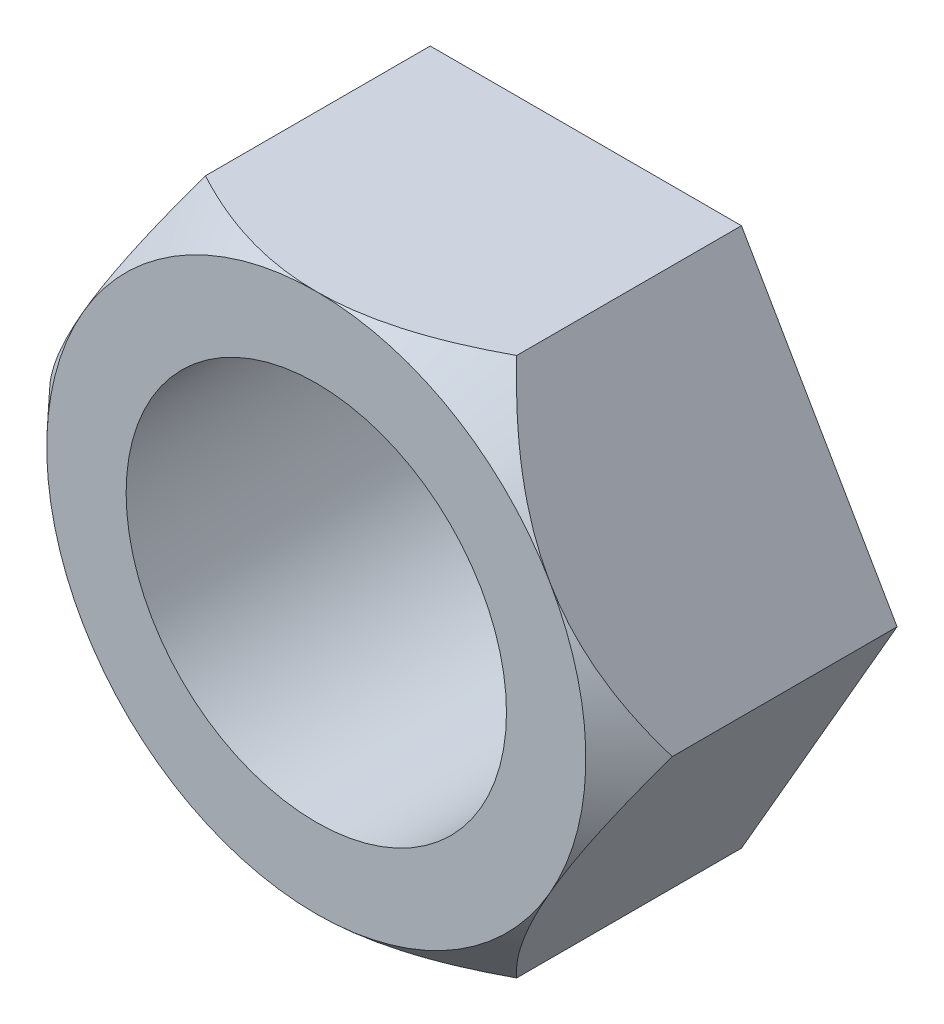
ISO-10303-21;
HEADER;
FILE_DESCRIPTION(('STEP AP214'),'2;1');
FILE_NAME('part.step','',(''),(''),'','','');
FILE_SCHEMA(('AUTOMOTIVE_DESIGN { 1 0 10303 214 1 1 1 1 }'));
ENDSEC;
DATA;
#1=APPLICATION_CONTEXT('core data for automotive mechanical design processes');
#2=APPLICATION_PROTOCOL_DEFINITION('international standard','automotive_design',2000,#1);
#3=PRODUCT_CONTEXT('',#1,'mechanical');
#4=PRODUCT('Part','Part','',(#3));
#5=PRODUCT_RELATED_PRODUCT_CATEGORY('part','',(#4));
#6=PRODUCT_DEFINITION_FORMATION('','',#4);
#7=PRODUCT_DEFINITION_CONTEXT('part definition',#1,'design');
#8=PRODUCT_DEFINITION('design','',#6,#7);
#9=PRODUCT_DEFINITION_SHAPE('','',#8);
#10=(LENGTH_UNIT() NAMED_UNIT(*) SI_UNIT(.MILLI.,.METRE.));
#11=(NAMED_UNIT(*) PLANE_ANGLE_UNIT() SI_UNIT($,.RADIAN.));
#12=(NAMED_UNIT(*) SI_UNIT($,.STERADIAN.) SOLID_ANGLE_UNIT());
#13=UNCERTAINTY_MEASURE_WITH_UNIT(LENGTH_MEASURE(1.E-05),#10,'distance_accuracy_value','');
#14=(GEOMETRIC_REPRESENTATION_CONTEXT(3) GLOBAL_UNCERTAINTY_ASSIGNED_CONTEXT((#13)) GLOBAL_UNIT_ASSIGNED_CONTEXT((#10,
#11,#12)) REPRESENTATION_CONTEXT('',''));
#15=CARTESIAN_POINT('',(0.,0.,0.));
#16=DIRECTION('',(0.,0.,1.));
#17=DIRECTION('',(1.,0.,0.));
#18=AXIS2_PLACEMENT_3D('',#15,#16,#17);
#19=CARTESIAN_POINT('',(0.,0.,9.));
#20=DIRECTION('',(0.,0.,1.));
#21=DIRECTION('',(1.,0.,0.));
#22=AXIS2_PLACEMENT_3D('',#19,#20,#21);
#23=PLANE('',#22);
#24=CARTESIAN_POINT('',(0.,0.,9.));
#25=DIRECTION('',(0.,0.,1.));
#26=DIRECTION('',(1.,0.,0.));
#27=AXIS2_PLACEMENT_3D('',#24,#25,#26);
#28=CIRCLE('',#27,6.35);
#29=CARTESIAN_POINT('',(6.35,0.,9.));
#30=VERTEX_POINT('',#29);
#31=EDGE_CURVE('E250',#30,#30,#28,.T.);
#32=ORIENTED_EDGE('',*,*,#31,.F.);
#33=EDGE_LOOP('',(#32));
#34=FACE_BOUND('',#33,.T.);
#35=CARTESIAN_POINT('',(0.,0.,9.));
#36=DIRECTION('',(0.,0.,1.));
#37=DIRECTION('',(1.,0.,0.));
#38=AXIS2_PLACEMENT_3D('',#35,#36,#37);
#39=CIRCLE('',#38,9.);
#40=CARTESIAN_POINT('',(7.79422863405995,-4.5,9.));
#41=VERTEX_POINT('',#40);
#42=CARTESIAN_POINT('',(7.79422863405994,4.5,9.));
#43=VERTEX_POINT('',#42);
#44=EDGE_CURVE('E143',#41,#43,#39,.T.);
#45=ORIENTED_EDGE('',*,*,#44,.T.);
#46=CARTESIAN_POINT('',(0.,9.,9.));
#47=VERTEX_POINT('',#46);
#48=EDGE_CURVE('E141',#43,#47,#39,.T.);
#49=ORIENTED_EDGE('',*,*,#48,.T.);
#50=CARTESIAN_POINT('',(-7.79422863405995,4.5,9.));
#51=VERTEX_POINT('',#50);
#52=EDGE_CURVE('E123',#47,#51,#39,.T.);
#53=ORIENTED_EDGE('',*,*,#52,.T.);
#54=CARTESIAN_POINT('',(-7.79422863405995,-4.5,9.));
#55=VERTEX_POINT('',#54);
#56=EDGE_CURVE('E113',#51,#55,#39,.T.);
#57=ORIENTED_EDGE('',*,*,#56,.T.);
#58=CARTESIAN_POINT('',(0.,-9.,9.));
#59=VERTEX_POINT('',#58);
#60=EDGE_CURVE('E58',#55,#59,#39,.T.);
#61=ORIENTED_EDGE('',*,*,#60,.T.);
#62=EDGE_CURVE('E66',#59,#41,#39,.T.);
#63=ORIENTED_EDGE('',*,*,#62,.T.);
#64=EDGE_LOOP('',(#45,#49,#53,#57,#61,#63));
#65=FACE_BOUND('',#64,.T.);
#66=ADVANCED_FACE('F37',(#34,#65),#23,.T.);
#67=CARTESIAN_POINT('',(-5.19615242270663,9.,9.));
#68=DIRECTION('',(0.866025403784439,-0.5,0.));
#69=DIRECTION('',(0.5,0.866025403784439,0.));
#70=AXIS2_PLACEMENT_3D('',#67,#68,#69);
#71=PLANE('',#70);
#72=CARTESIAN_POINT('',(-5.19603695265279,9.0002,7.50681202042663));
#73=CARTESIAN_POINT('',(-5.28019623549433,8.85443184618989,7.59704816030828));
#74=CARTESIAN_POINT('',(-5.36504470608609,8.70746998418046,7.6847668820848));
#75=CARTESIAN_POINT('',(-5.53623851819724,8.41095360366254,7.85437474608275));
#76=CARTESIAN_POINT('',(-5.62258461728649,8.26139777300458,7.9362608242077));
#77=CARTESIAN_POINT('',(-5.79732480629788,7.95873888751266,8.09378177008495));
#78=CARTESIAN_POINT('',(-5.88572804766327,7.80561998191404,8.16937638262129));
#79=CARTESIAN_POINT('',(-6.06407665216607,7.49671113745619,8.31275392588267));
#80=CARTESIAN_POINT('',(-6.15402178754604,7.34092159308441,8.38053799909498));
#81=CARTESIAN_POINT('',(-6.42360941659665,6.87398212247673,8.56875508198224));
#82=CARTESIAN_POINT('',(-6.60559427490573,6.55877510167717,8.67644726521777));
#83=CARTESIAN_POINT('',(-6.88206689208951,6.07991048181333,8.80560687733029));
#84=CARTESIAN_POINT('',(-6.97471112789866,5.9194459583635,8.84324179076753));
#85=CARTESIAN_POINT('',(-7.16098651131064,5.59680753009457,8.90690355897231));
#86=CARTESIAN_POINT('',(-7.25461748508753,5.43463392635084,8.9329324244198));
#87=CARTESIAN_POINT('',(-7.47709898186135,5.04928467019461,8.97994495044793));
#88=CARTESIAN_POINT('',(-7.60624497252212,4.82559725277634,8.99555750518295));
#89=CARTESIAN_POINT('',(-7.86473555417963,4.3778784320675,9.00279817317157));
#90=CARTESIAN_POINT('',(-7.99408019053368,4.15384695021577,8.99441959342381));
#91=CARTESIAN_POINT('',(-8.25196226036209,3.70718210291195,8.95412545501114));
#92=CARTESIAN_POINT('',(-8.38049879983856,3.4845502859096,8.92218731126235));
#93=CARTESIAN_POINT('',(-8.63569649967964,3.04253490381015,8.83643798063319));
#94=CARTESIAN_POINT('',(-8.76235779422312,2.8231511063084,8.78262836663216));
#95=CARTESIAN_POINT('',(-9.01919873027657,2.37828955560028,8.65255549521353));
#96=CARTESIAN_POINT('',(-9.14925652503363,2.15302284716067,8.57534064641109));
#97=CARTESIAN_POINT('',(-9.40635746677677,1.70771095338775,8.40269573435019));
#98=CARTESIAN_POINT('',(-9.53339891212116,1.48766871538428,8.30725565172166));
#99=CARTESIAN_POINT('',(-9.78426874856057,1.05314941258473,8.10130006898129));
#100=CARTESIAN_POINT('',(-9.90809888974104,0.838669316551733,7.99079299464056));
#101=CARTESIAN_POINT('',(-10.1525587137647,0.415252480933393,7.75743806238574));
#102=CARTESIAN_POINT('',(-10.2731936925796,0.206306568455977,7.63461248197722));
#103=CARTESIAN_POINT('',(-10.3924203154671,-0.000200000000000428,7.50681202042663));
#104=B_SPLINE_CURVE_WITH_KNOTS('',3,(#72,#73,#74,#75,#76,#77,#78,#79,#80,#81,#82,#83,#84,#85,
#86,#87,#88,#89,#90,#91,#92,#93,#94,#95,#96,#97,#98,#99,#100,#101,#102,#103),.UNSPECIFIED.,.F.,
.F.,(4,2,2,2,2,2,2,2,2,2,2,2,2,2,2,4),(0.,0.572956584634736,1.1462119772137,1.72289105227757,
2.29948566619176,3.43561287145932,4.00252611192057,4.56934109978161,5.34449885735668,
6.11987288804584,6.89599118899015,7.67205368552315,8.48526818620072,9.29893104748471,
10.1121407439293,10.9239054317707),.UNSPECIFIED.);
#105=CARTESIAN_POINT('',(-5.19615242270663,9.,7.50693584896306));
#106=VERTEX_POINT('',#105);
#107=EDGE_CURVE('E128',#106,#51,#104,.T.);
#108=ORIENTED_EDGE('',*,*,#107,.F.);
#109=DIRECTION('',(0.,0.,-1.));
#110=VECTOR('',#109,1.);
#111=CARTESIAN_POINT('',(-5.19615242270663,9.,9.));
#112=LINE('',#111,#110);
#113=CARTESIAN_POINT('',(-5.19615242270663,9.,0.));
#114=VERTEX_POINT('',#113);
#115=EDGE_CURVE('E228',#106,#114,#112,.T.);
#116=ORIENTED_EDGE('',*,*,#115,.T.);
#117=DIRECTION('',(-0.5,-0.866025403784439,0.));
#118=VECTOR('',#117,1.);
#119=CARTESIAN_POINT('',(-5.19615242270663,9.,0.));
#120=LINE('',#119,#118);
#121=CARTESIAN_POINT('',(-10.3923048454133,0.,0.));
#122=VERTEX_POINT('',#121);
#123=EDGE_CURVE('E245',#114,#122,#120,.T.);
#124=ORIENTED_EDGE('',*,*,#123,.T.);
#125=DIRECTION('',(0.,0.,-1.));
#126=VECTOR('',#125,1.);
#127=CARTESIAN_POINT('',(-10.3923048454133,0.,9.));
#128=LINE('',#127,#126);
#129=CARTESIAN_POINT('',(-10.3923048454133,0.,7.50693584896306));
#130=VERTEX_POINT('',#129);
#131=EDGE_CURVE('E137',#130,#122,#128,.T.);
#132=ORIENTED_EDGE('',*,*,#131,.F.);
#133=EDGE_CURVE('E117',#51,#130,#104,.T.);
#134=ORIENTED_EDGE('',*,*,#133,.F.);
#135=EDGE_LOOP('',(#108,#116,#124,#132,#134));
#136=FACE_BOUND('',#135,.T.);
#137=ADVANCED_FACE('F39',(#136),#71,.F.);
#138=CARTESIAN_POINT('',(-10.3923048454133,0.,9.));
#139=DIRECTION('',(0.866025403784439,0.5,0.));
#140=DIRECTION('',(-0.5,0.866025403784439,0.));
#141=AXIS2_PLACEMENT_3D('',#138,#139,#140);
#142=PLANE('',#141);
#143=CARTESIAN_POINT('',(-10.3924203154671,0.000200000000000102,7.50681202042663));
#144=CARTESIAN_POINT('',(-10.3082610326256,-0.145568153810111,7.59704816030829));
#145=CARTESIAN_POINT('',(-10.2234125620338,-0.292530015819545,7.6847668820848));
#146=CARTESIAN_POINT('',(-10.0522187499227,-0.589046396337457,7.85437474608275));
#147=CARTESIAN_POINT('',(-9.9658726508334,-0.738602226995418,7.93626082420769));
#148=CARTESIAN_POINT('',(-9.79113246182201,-1.04126111248734,8.09378177008495));
#149=CARTESIAN_POINT('',(-9.70272922045663,-1.19438001808595,8.16937638262129));
#150=CARTESIAN_POINT('',(-9.52438061595383,-1.50328886254381,8.31275392588267));
#151=CARTESIAN_POINT('',(-9.43443548057385,-1.65907840691559,8.38053799909497));
#152=CARTESIAN_POINT('',(-9.16484785152324,-2.12601787752328,8.56875508198224));
#153=CARTESIAN_POINT('',(-8.98286299321416,-2.44122489832283,8.67644726521777));
#154=CARTESIAN_POINT('',(-8.70639037603039,-2.92008951818666,8.80560687733029));
#155=CARTESIAN_POINT('',(-8.61374614022124,-3.0805540416365,8.84324179076753));
#156=CARTESIAN_POINT('',(-8.42747075680926,-3.40319246990542,8.90690355897231));
#157=CARTESIAN_POINT('',(-8.33383978303237,-3.56536607364916,8.9329324244198));
#158=CARTESIAN_POINT('',(-8.11135828625854,-3.95071532980539,8.97994495044793));
#159=CARTESIAN_POINT('',(-7.98221229559777,-4.17440274722366,8.99555750518294));
#160=CARTESIAN_POINT('',(-7.72372171394026,-4.62212156793249,9.00279817317157));
#161=CARTESIAN_POINT('',(-7.59437707758622,-4.84615304978423,8.99441959342381));
#162=CARTESIAN_POINT('',(-7.33649500775781,-5.29281789708805,8.95412545501114));
#163=CARTESIAN_POINT('',(-7.20795846828133,-5.51544971409039,8.92218731126235));
#164=CARTESIAN_POINT('',(-6.95276076844026,-5.95746509618985,8.83643798063319));
#165=CARTESIAN_POINT('',(-6.82609947389678,-6.1768488936916,8.78262836663216));
#166=CARTESIAN_POINT('',(-6.56925853784333,-6.62171044439972,8.65255549521353));
#167=CARTESIAN_POINT('',(-6.43920074308626,-6.84697715283932,8.57534064641109));
#168=CARTESIAN_POINT('',(-6.18209980134313,-7.29228904661224,8.40269573435019));
#169=CARTESIAN_POINT('',(-6.05505835599874,-7.51233128461572,8.30725565172166));
#170=CARTESIAN_POINT('',(-5.80418851955933,-7.94685058741527,8.10130006898129));
#171=CARTESIAN_POINT('',(-5.68035837837886,-8.16133068344827,7.99079299464056));
#172=CARTESIAN_POINT('',(-5.43589855435519,-8.58474751906661,7.75743806238573));
#173=CARTESIAN_POINT('',(-5.31526357554028,-8.79369343154402,7.63461248197722));
#174=CARTESIAN_POINT('',(-5.1960369526528,-9.0002,7.50681202042663));
#175=B_SPLINE_CURVE_WITH_KNOTS('',3,(#143,#144,#145,#146,#147,#148,#149,#150,#151,#152,#153,
#154,#155,#156,#157,#158,#159,#160,#161,#162,#163,#164,#165,#166,#167,#168,#169,#170,#171,#172,
#173,#174),.UNSPECIFIED.,.F.,.F.,(4,2,2,2,2,2,2,2,2,2,2,2,2,2,2,4),(0.,0.572956584634732,
1.1462119772137,1.72289105227756,2.29948566619176,3.43561287145932,4.00252611192057,
4.5693410997816,5.34449885735667,6.11987288804583,6.89599118899015,7.67205368552314,
8.48526818620071,9.2989310474847,10.1121407439293,10.9239054317707),.UNSPECIFIED.);
#176=EDGE_CURVE('E119',#130,#55,#175,.T.);
#177=ORIENTED_EDGE('',*,*,#176,.F.);
#178=ORIENTED_EDGE('',*,*,#131,.T.);
#179=DIRECTION('',(0.5,-0.866025403784439,0.));
#180=VECTOR('',#179,1.);
#181=CARTESIAN_POINT('',(-10.3923048454133,0.,0.));
#182=LINE('',#181,#180);
#183=CARTESIAN_POINT('',(-5.19615242270663,-9.,0.));
#184=VERTEX_POINT('',#183);
#185=EDGE_CURVE('E241',#122,#184,#182,.T.);
#186=ORIENTED_EDGE('',*,*,#185,.T.);
#187=DIRECTION('',(0.,0.,-1.));
#188=VECTOR('',#187,1.);
#189=CARTESIAN_POINT('',(-5.19615242270663,-9.,9.));
#190=LINE('',#189,#188);
#191=CARTESIAN_POINT('',(-5.19615242270663,-9.,7.50693584896306));
#192=VERTEX_POINT('',#191);
#193=EDGE_CURVE('E237',#192,#184,#190,.T.);
#194=ORIENTED_EDGE('',*,*,#193,.F.);
#195=EDGE_CURVE('E182',#55,#192,#175,.T.);
#196=ORIENTED_EDGE('',*,*,#195,.F.);
#197=EDGE_LOOP('',(#177,#178,#186,#194,#196));
#198=FACE_BOUND('',#197,.T.);
#199=ADVANCED_FACE('F190',(#198),#142,.F.);
#200=CARTESIAN_POINT('',(-5.19615242270663,-9.,9.));
#201=DIRECTION('',(0.,1.,0.));
#202=DIRECTION('',(-1.,0.,0.));
#203=AXIS2_PLACEMENT_3D('',#200,#201,#202);
#204=PLANE('',#203);
#205=CARTESIAN_POINT('',(-11.1503594989457,-9.,3.28496262772064));
#206=CARTESIAN_POINT('',(-10.8880406830711,-9.,3.50380974535469));
#207=CARTESIAN_POINT('',(-10.6242555828126,-9.,3.72092563252449));
#208=CARTESIAN_POINT('',(-10.0931384124816,-9.,4.15089596925367));
#209=CARTESIAN_POINT('',(-9.82580554450159,-9.,4.36374943221405));
#210=CARTESIAN_POINT('',(-9.28495458196367,-9.,4.78596826931578));
#211=CARTESIAN_POINT('',(-9.01140419625685,-9.,4.99529240798222));
#212=CARTESIAN_POINT('',(-8.4595088375458,-9.,5.4074973160336));
#213=CARTESIAN_POINT('',(-8.18116420752812,-9.,5.61037854342406));
#214=CARTESIAN_POINT('',(-7.59869471796184,-9.,6.02243656523547));
#215=CARTESIAN_POINT('',(-7.29415092922537,-9.,6.23102406404039));
#216=CARTESIAN_POINT('',(-6.67731568071419,-9.,6.63661733159347));
#217=CARTESIAN_POINT('',(-6.36502275345393,-9.,6.83362088246998));
#218=CARTESIAN_POINT('',(-5.73240291275896,-9.,7.21201823972017));
#219=CARTESIAN_POINT('',(-5.41210477997095,-9.,7.3934597996667));
#220=CARTESIAN_POINT('',(-4.76130371421665,-9.,7.7368487444568));
#221=CARTESIAN_POINT('',(-4.43080623515798,-9.,7.89880632857513));
#222=CARTESIAN_POINT('',(-3.80959581008275,-9.,8.17466653146566));
#223=CARTESIAN_POINT('',(-3.52047851874473,-9.,8.29213149695269));
#224=CARTESIAN_POINT('',(-2.93389644813044,-9.,8.50444446498391));
#225=CARTESIAN_POINT('',(-2.63643079349771,-9.,8.59929008582963));
#226=CARTESIAN_POINT('',(-2.03923048371147,-9.,8.76012031597471));
#227=CARTESIAN_POINT('',(-1.73962554329817,-9.,8.82657874252282));
#228=CARTESIAN_POINT('',(-1.13518736022374,-9.,8.92878690606296));
#229=CARTESIAN_POINT('',(-0.830355456037406,-9.,8.96454438835297));
#230=CARTESIAN_POINT('',(-0.2294481219949,-9.,9.00203067223543));
#231=CARTESIAN_POINT('',(0.0665537104399286,-9.,9.00492313163866));
#232=CARTESIAN_POINT('',(0.65718667583738,-9.,8.97948020041617));
#233=CARTESIAN_POINT('',(0.951817800502624,-9.,8.95114462100245));
#234=CARTESIAN_POINT('',(1.53861917579772,-9.,8.8649778029288));
#235=CARTESIAN_POINT('',(1.83076085593261,-9.,8.80695545384971));
#236=CARTESIAN_POINT('',(2.40860656888926,-9.,8.66491223926435));
#237=CARTESIAN_POINT('',(2.6943087183064,-9.00000000000001,8.58088387083165));
#238=CARTESIAN_POINT('',(3.38317917451741,-9.00000000000001,8.34895710651916));
#239=CARTESIAN_POINT('',(3.78236638904372,-9.00000000000001,8.18925086869199));
#240=CARTESIAN_POINT('',(4.36945339846447,-9.00000000000001,7.92438258845721));
#241=CARTESIAN_POINT('',(4.56328305993464,-9.00000000000001,7.83182856483977));
#242=CARTESIAN_POINT('',(4.94730130408878,-9.00000000000001,7.63944566197792));
#243=CARTESIAN_POINT('',(5.13749018258271,-9.00000000000001,7.53961737695488));
#244=CARTESIAN_POINT('',(5.51625343334525,-9.00000000000001,7.3327608762893));
#245=CARTESIAN_POINT('',(5.70479497268501,-9.00000000000001,7.22567293665177));
#246=CARTESIAN_POINT('',(6.07868528069268,-9.00000000000001,7.00606800586898));
#247=CARTESIAN_POINT('',(6.26403401222233,-9.00000000000001,6.89355095163085));
#248=CARTESIAN_POINT('',(6.63173443874935,-9.00000000000001,6.66390649660787));
#249=CARTESIAN_POINT('',(6.81408738603259,-9.00000000000001,6.54678109547894));
#250=CARTESIAN_POINT('',(7.17613784853634,-9.00000000000001,6.30852070812906));
#251=CARTESIAN_POINT('',(7.35583547367288,-9.00000000000001,6.18738588855272));
#252=CARTESIAN_POINT('',(7.74791482954226,-9.00000000000001,5.91749447160861));
#253=CARTESIAN_POINT('',(7.95977982091077,-9.00000000000001,5.76798781813382));
#254=CARTESIAN_POINT('',(8.38047226208432,-9.00000000000001,5.46475383297362));
#255=CARTESIAN_POINT('',(8.58929957629799,-9.00000000000001,5.31102631376238));
#256=CARTESIAN_POINT('',(9.21182523941578,-9.00000000000001,4.84441633793116));
#257=CARTESIAN_POINT('',(9.62149576548575,-9.00000000000001,4.52615632634234));
#258=CARTESIAN_POINT('',(10.4326602494269,-9.00000000000001,3.8787964364527));
#259=CARTESIAN_POINT('',(10.8341473303553,-9.00000000000001,3.5496880040297));
#260=CARTESIAN_POINT('',(11.6303020156002,-9.00000000000001,2.88341361705972));
#261=CARTESIAN_POINT('',(12.0249702207949,-9.00000000000001,2.54624837878133));
#262=CARTESIAN_POINT('',(12.8102086778178,-9.00000000000001,1.86444138555726));
#263=CARTESIAN_POINT('',(13.2007597241188,-9.00000000000001,1.51977757220307));
#264=CARTESIAN_POINT('',(13.9773781615401,-9.00000000000001,0.825429127942955));
#265=CARTESIAN_POINT('',(14.363445468213,-9.00000000000001,0.475744402748927));
#266=CARTESIAN_POINT('',(15.1317057146132,-9.00000000000001,-0.227503690365759));
#267=CARTESIAN_POINT('',(15.5139003248129,-9.00000000000001,-0.581065235918496));
#268=CARTESIAN_POINT('',(16.275203455695,-9.00000000000001,-1.29148600606377));
#269=CARTESIAN_POINT('',(16.6543119980762,-9.00000000000001,-1.6483452074321));
#270=CARTESIAN_POINT('',(17.706850013612,-9.00000000000001,-2.64628027277313));
#271=CARTESIAN_POINT('',(18.3774568398783,-9.00000000000001,-3.29033273151824));
#272=CARTESIAN_POINT('',(19.7126024375581,-9.00000000000001,-4.5848515514358));
#273=CARTESIAN_POINT('',(20.3771404129455,-9.00000000000001,-5.23531873137349));
#274=CARTESIAN_POINT('',(21.6968555141113,-9.00000000000001,-6.53649009018855));
#275=CARTESIAN_POINT('',(22.3520656025859,-9.00000000000001,-7.18716086264747));
#276=CARTESIAN_POINT('',(23.3320730413062,-9.00000000000001,-8.16586692664744));
#277=CARTESIAN_POINT('',(23.6582476457769,-9.00000000000001,-8.49252540772975));
#278=CARTESIAN_POINT('',(24.309772301137,-9.00000000000001,-9.14666192517312));
#279=CARTESIAN_POINT('',(24.6351223542843,-9.00000000000001,-9.47413995928505));
#280=CARTESIAN_POINT('',(24.9601076330872,-9.00000000000001,-9.80197970693675));
#281=B_SPLINE_CURVE_WITH_KNOTS('',3,(#205,#206,#207,#208,#209,#210,#211,#212,#213,#214,#215,
#216,#217,#218,#219,#220,#221,#222,#223,#224,#225,#226,#227,#228,#229,#230,#231,#232,#233,#234,
#235,#236,#237,#238,#239,#240,#241,#242,#243,#244,#245,#246,#247,#248,#249,#250,#251,#252,#253,
#254,#255,#256,#257,#258,#259,#260,#261,#262,#263,#264,#265,#266,#267,#268,#269,#270,#271,#272,
#273,#274,#275,#276,#277,#278,#279,#280),.UNSPECIFIED.,.F.,.F.,(4,2,2,2,2,2,2,2,2,2,2,2,2,2,2,2,
2,2,2,2,2,2,2,2,2,2,2,2,2,2,2,2,2,2,2,2,2,4),(0.,1.02488190195688,2.04999834770041,
3.08327226824534,4.11647257155089,5.22364890106569,6.33103652577769,7.43489442193832,
8.53817194393607,9.47362247008043,10.4091714508188,11.3284290275497,12.2474546238688,
13.1338342937208,14.020219322179,14.9123836807711,15.8048056756168,17.0922403926905,
17.7365267058593,18.3807604473077,19.0311550510503,19.681557214984,20.3316802030778,
20.9817762037698,21.7596269746958,22.5375123602959,24.0935445903016,25.6508345902044,
27.2079866547715,28.7705951063357,30.3332329407294,31.8951652900726,33.4570866476583,
36.2464045059453,39.0360831191372,41.8062714771912,43.1911388845996,44.5760024956439),.UNSPECIFIED.);
#282=EDGE_CURVE('E180',#192,#59,#281,.T.);
#283=ORIENTED_EDGE('',*,*,#282,.F.);
#284=ORIENTED_EDGE('',*,*,#193,.T.);
#285=DIRECTION('',(1.,0.,0.));
#286=VECTOR('',#285,1.);
#287=CARTESIAN_POINT('',(-5.19615242270663,-9.,0.));
#288=LINE('',#287,#286);
#289=CARTESIAN_POINT('',(5.19615242270663,-9.00000000000001,0.));
#290=VERTEX_POINT('',#289);
#291=EDGE_CURVE('E248',#184,#290,#288,.T.);
#292=ORIENTED_EDGE('',*,*,#291,.T.);
#293=DIRECTION('',(0.,0.,-1.));
#294=VECTOR('',#293,1.);
#295=CARTESIAN_POINT('',(5.19615242270663,-9.00000000000001,9.));
#296=LINE('',#295,#294);
#297=CARTESIAN_POINT('',(5.19615242270663,-9.00000000000001,7.50693584896306));
#298=VERTEX_POINT('',#297);
#299=EDGE_CURVE('E230',#298,#290,#296,.T.);
#300=ORIENTED_EDGE('',*,*,#299,.F.);
#301=EDGE_CURVE('E175',#59,#298,#281,.T.);
#302=ORIENTED_EDGE('',*,*,#301,.F.);
#303=EDGE_LOOP('',(#283,#284,#292,#300,#302));
#304=FACE_BOUND('',#303,.T.);
#305=ADVANCED_FACE('F186',(#304),#204,.F.);
#306=CARTESIAN_POINT('',(5.19615242270663,-9.00000000000001,9.));
#307=DIRECTION('',(-0.866025403784439,0.5,0.));
#308=DIRECTION('',(-0.5,-0.866025403784439,0.));
#309=AXIS2_PLACEMENT_3D('',#306,#307,#308);
#310=PLANE('',#309);
#311=CARTESIAN_POINT('',(5.19603695265279,-9.0002,7.50681202042663));
#312=CARTESIAN_POINT('',(5.28019623549433,-8.85443184618989,7.59704816030828));
#313=CARTESIAN_POINT('',(5.36504470608609,-8.70746998418046,7.6847668820848));
#314=CARTESIAN_POINT('',(5.53623851819724,-8.41095360366254,7.85437474608274));
#315=CARTESIAN_POINT('',(5.62258461728649,-8.26139777300459,7.93626082420769));
#316=CARTESIAN_POINT('',(5.79732480629788,-7.95873888751267,8.09378177008495));
#317=CARTESIAN_POINT('',(5.88572804766327,-7.80561998191405,8.16937638262129));
#318=CARTESIAN_POINT('',(6.06407665216607,-7.49671113745619,8.31275392588267));
#319=CARTESIAN_POINT('',(6.15402178754604,-7.34092159308441,8.38053799909497));
#320=CARTESIAN_POINT('',(6.42360941659665,-6.87398212247673,8.56875508198224));
#321=CARTESIAN_POINT('',(6.60559427490573,-6.55877510167717,8.67644726521777));
#322=CARTESIAN_POINT('',(6.88206689208951,-6.07991048181333,8.80560687733029));
#323=CARTESIAN_POINT('',(6.97471112789866,-5.9194459583635,8.84324179076753));
#324=CARTESIAN_POINT('',(7.16098651131064,-5.59680753009457,8.90690355897231));
#325=CARTESIAN_POINT('',(7.25461748508753,-5.43463392635084,8.9329324244198));
#326=CARTESIAN_POINT('',(7.47709898186135,-5.04928467019461,8.97994495044793));
#327=CARTESIAN_POINT('',(7.60624497252212,-4.82559725277634,8.99555750518295));
#328=CARTESIAN_POINT('',(7.86473555417963,-4.3778784320675,9.00279817317157));
#329=CARTESIAN_POINT('',(7.99408019053368,-4.15384695021577,8.99441959342381));
#330=CARTESIAN_POINT('',(8.25196226036209,-3.70718210291195,8.95412545501114));
#331=CARTESIAN_POINT('',(8.38049879983856,-3.4845502859096,8.92218731126235));
#332=CARTESIAN_POINT('',(8.63569649967964,-3.04253490381015,8.83643798063319));
#333=CARTESIAN_POINT('',(8.76235779422312,-2.8231511063084,8.78262836663216));
#334=CARTESIAN_POINT('',(9.01919873027656,-2.37828955560028,8.65255549521353));
#335=CARTESIAN_POINT('',(9.14925652503363,-2.15302284716067,8.57534064641109));
#336=CARTESIAN_POINT('',(9.40635746677677,-1.70771095338775,8.40269573435019));
#337=CARTESIAN_POINT('',(9.53339891212116,-1.48766871538429,8.30725565172166));
#338=CARTESIAN_POINT('',(9.78426874856057,-1.05314941258473,8.10130006898129));
#339=CARTESIAN_POINT('',(9.90809888974104,-0.838669316551736,7.99079299464057));
#340=CARTESIAN_POINT('',(10.1525587137647,-0.415252480933395,7.75743806238574));
#341=CARTESIAN_POINT('',(10.2731936925796,-0.206306568455979,7.63461248197723));
#342=CARTESIAN_POINT('',(10.3924203154671,0.000199999999997386,7.50681202042663));
#343=B_SPLINE_CURVE_WITH_KNOTS('',3,(#311,#312,#313,#314,#315,#316,#317,#318,#319,#320,#321,
#322,#323,#324,#325,#326,#327,#328,#329,#330,#331,#332,#333,#334,#335,#336,#337,#338,#339,#340,
#341,#342),.UNSPECIFIED.,.F.,.F.,(4,2,2,2,2,2,2,2,2,2,2,2,2,2,2,4),(0.,0.572956584634733,
1.1462119772137,1.72289105227756,2.29948566619176,3.43561287145933,4.00252611192057,
4.56934109978161,5.34449885735668,6.11987288804584,6.89599118899016,7.67205368552315,
8.48526818620071,9.29893104748471,10.1121407439293,10.9239054317707),.UNSPECIFIED.);
#344=EDGE_CURVE('E181',#298,#41,#343,.T.);
#345=ORIENTED_EDGE('',*,*,#344,.F.);
#346=ORIENTED_EDGE('',*,*,#299,.T.);
#347=DIRECTION('',(0.5,0.866025403784439,0.));
#348=VECTOR('',#347,1.);
#349=CARTESIAN_POINT('',(5.19615242270663,-9.00000000000001,0.));
#350=LINE('',#349,#348);
#351=CARTESIAN_POINT('',(10.3923048454133,0.,0.));
#352=VERTEX_POINT('',#351);
#353=EDGE_CURVE('E256',#290,#352,#350,.T.);
#354=ORIENTED_EDGE('',*,*,#353,.T.);
#355=DIRECTION('',(0.,0.,-1.));
#356=VECTOR('',#355,1.);
#357=CARTESIAN_POINT('',(10.3923048454133,0.,9.));
#358=LINE('',#357,#356);
#359=CARTESIAN_POINT('',(10.3923048454133,0.,7.50693584896307));
#360=VERTEX_POINT('',#359);
#361=EDGE_CURVE('E227',#360,#352,#358,.T.);
#362=ORIENTED_EDGE('',*,*,#361,.F.);
#363=EDGE_CURVE('E151',#41,#360,#343,.T.);
#364=ORIENTED_EDGE('',*,*,#363,.F.);
#365=EDGE_LOOP('',(#345,#346,#354,#362,#364));
#366=FACE_BOUND('',#365,.T.);
#367=ADVANCED_FACE('F189',(#366),#310,.F.);
#368=CARTESIAN_POINT('',(10.3923048454133,0.,9.));
#369=DIRECTION('',(-0.866025403784439,-0.5,0.));
#370=DIRECTION('',(0.5,-0.866025403784439,0.));
#371=AXIS2_PLACEMENT_3D('',#368,#369,#370);
#372=PLANE('',#371);
#373=CARTESIAN_POINT('',(10.3924203154671,-0.000200000000002761,7.50681202042663));
#374=CARTESIAN_POINT('',(10.3082610326256,0.145568153810109,7.59704816030829));
#375=CARTESIAN_POINT('',(10.2234125620338,0.292530015819543,7.68476688208481));
#376=CARTESIAN_POINT('',(10.0522187499227,0.589046396337456,7.85437474608275));
#377=CARTESIAN_POINT('',(9.9658726508334,0.738602226995417,7.9362608242077));
#378=CARTESIAN_POINT('',(9.79113246182201,1.04126111248734,8.09378177008496));
#379=CARTESIAN_POINT('',(9.70272922045662,1.19438001808595,8.1693763826213));
#380=CARTESIAN_POINT('',(9.52438061595382,1.50328886254381,8.31275392588267));
#381=CARTESIAN_POINT('',(9.43443548057385,1.65907840691559,8.38053799909498));
#382=CARTESIAN_POINT('',(9.16484785152324,2.12601787752328,8.56875508198224));
#383=CARTESIAN_POINT('',(8.98286299321416,2.44122489832283,8.67644726521777));
#384=CARTESIAN_POINT('',(8.70639037603038,2.92008951818667,8.80560687733029));
#385=CARTESIAN_POINT('',(8.61374614022123,3.0805540416365,8.84324179076754));
#386=CARTESIAN_POINT('',(8.42747075680925,3.40319246990543,8.90690355897231));
#387=CARTESIAN_POINT('',(8.33383978303236,3.56536607364916,8.9329324244198));
#388=CARTESIAN_POINT('',(8.11135828625854,3.95071532980539,8.97994495044794));
#389=CARTESIAN_POINT('',(7.98221229559777,4.17440274722366,8.99555750518295));
#390=CARTESIAN_POINT('',(7.72372171394026,4.62212156793249,9.00279817317157));
#391=CARTESIAN_POINT('',(7.59437707758621,4.84615304978423,8.99441959342381));
#392=CARTESIAN_POINT('',(7.3364950077578,5.29281789708805,8.95412545501115));
#393=CARTESIAN_POINT('',(7.20795846828133,5.51544971409039,8.92218731126236));
#394=CARTESIAN_POINT('',(6.95276076844025,5.95746509618985,8.83643798063319));
#395=CARTESIAN_POINT('',(6.82609947389677,6.1768488936916,8.78262836663217));
#396=CARTESIAN_POINT('',(6.56925853784333,6.62171044439972,8.65255549521354));
#397=CARTESIAN_POINT('',(6.43920074308626,6.84697715283933,8.57534064641109));
#398=CARTESIAN_POINT('',(6.18209980134312,7.29228904661224,8.40269573435019));
#399=CARTESIAN_POINT('',(6.05505835599873,7.51233128461572,8.30725565172166));
#400=CARTESIAN_POINT('',(5.80418851955932,7.94685058741527,8.10130006898129));
#401=CARTESIAN_POINT('',(5.68035837837885,8.16133068344827,7.99079299464056));
#402=CARTESIAN_POINT('',(5.43589855435518,8.58474751906661,7.75743806238574));
#403=CARTESIAN_POINT('',(5.31526357554027,8.79369343154403,7.63461248197722));
#404=CARTESIAN_POINT('',(5.19603695265279,9.0002,7.50681202042663));
#405=B_SPLINE_CURVE_WITH_KNOTS('',3,(#373,#374,#375,#376,#377,#378,#379,#380,#381,#382,#383,
#384,#385,#386,#387,#388,#389,#390,#391,#392,#393,#394,#395,#396,#397,#398,#399,#400,#401,#402,
#403,#404),.UNSPECIFIED.,.F.,.F.,(4,2,2,2,2,2,2,2,2,2,2,2,2,2,2,4),(0.,0.572956584634733,
1.1462119772137,1.72289105227756,2.29948566619176,3.43561287145933,4.00252611192057,
4.56934109978161,5.34449885735668,6.11987288804583,6.89599118899015,7.67205368552314,
8.48526818620071,9.29893104748471,10.1121407439293,10.9239054317707),.UNSPECIFIED.);
#406=EDGE_CURVE('E150',#360,#43,#405,.T.);
#407=ORIENTED_EDGE('',*,*,#406,.F.);
#408=ORIENTED_EDGE('',*,*,#361,.T.);
#409=DIRECTION('',(-0.5,0.866025403784439,0.));
#410=VECTOR('',#409,1.);
#411=CARTESIAN_POINT('',(10.3923048454133,0.,0.));
#412=LINE('',#411,#410);
#413=CARTESIAN_POINT('',(5.19615242270663,9.,0.));
#414=VERTEX_POINT('',#413);
#415=EDGE_CURVE('E225',#352,#414,#412,.T.);
#416=ORIENTED_EDGE('',*,*,#415,.T.);
#417=DIRECTION('',(0.,0.,-1.));
#418=VECTOR('',#417,1.);
#419=CARTESIAN_POINT('',(5.19615242270663,9.,9.));
#420=LINE('',#419,#418);
#421=CARTESIAN_POINT('',(5.19615242270663,9.,7.50693584896306));
#422=VERTEX_POINT('',#421);
#423=EDGE_CURVE('E219',#422,#414,#420,.T.);
#424=ORIENTED_EDGE('',*,*,#423,.F.);
#425=EDGE_CURVE('E142',#43,#422,#405,.T.);
#426=ORIENTED_EDGE('',*,*,#425,.F.);
#427=EDGE_LOOP('',(#407,#408,#416,#424,#426));
#428=FACE_BOUND('',#427,.T.);
#429=ADVANCED_FACE('F157',(#428),#372,.F.);
#430=CARTESIAN_POINT('',(5.19615242270663,9.,9.));
#431=DIRECTION('',(0.,-1.,0.));
#432=DIRECTION('',(1.,0.,0.));
#433=AXIS2_PLACEMENT_3D('',#430,#431,#432);
#434=PLANE('',#433);
#435=CARTESIAN_POINT('',(-11.1503594997577,9.00000000000001,3.28496262704309));
#436=CARTESIAN_POINT('',(-10.8880406838589,9.,3.5038097447036));
#437=CARTESIAN_POINT('',(-10.6242555835761,9.,3.72092563189979));
#438=CARTESIAN_POINT('',(-10.0931384131964,9.,4.15089596868163));
#439=CARTESIAN_POINT('',(-9.8258055451919,9.,4.36374943166827));
#440=CARTESIAN_POINT('',(-9.28495458260417,9.,4.7859682688227));
#441=CARTESIAN_POINT('',(-9.01140419687202,9.,4.99529240751559));
#442=CARTESIAN_POINT('',(-8.45950883810987,9.,5.40749731561947));
#443=CARTESIAN_POINT('',(-8.18116420806639,9.,5.61037854303598));
#444=CARTESIAN_POINT('',(-7.59869471844519,9.,6.02243656490134));
#445=CARTESIAN_POINT('',(-7.29415092967951,9.,6.23102406373408));
#446=CARTESIAN_POINT('',(-6.67731568110884,9.,6.63661733134167));
#447=CARTESIAN_POINT('',(-6.36502275381828,9.,6.83362088224485));
#448=CARTESIAN_POINT('',(-5.73240291306155,9.,7.21201823954635));
#449=CARTESIAN_POINT('',(-5.41210478024208,9.,7.39345979951753));
#450=CARTESIAN_POINT('',(-4.76130371442299,9.,7.73684874435402));
#451=CARTESIAN_POINT('',(-4.43080623533099,9.,7.89880632849411));
#452=CARTESIAN_POINT('',(-3.8095958102407,9.,8.17466653139905));
#453=CARTESIAN_POINT('',(-3.52047851892268,9.,8.29213149688249));
#454=CARTESIAN_POINT('',(-2.93389644834935,9.,8.50444446491046));
#455=CARTESIAN_POINT('',(-2.63643079373761,9.,8.59929008575651));
#456=CARTESIAN_POINT('',(-2.03923048399267,9.,8.76012031590733));
#457=CARTESIAN_POINT('',(-1.73962554359968,9.,8.82657874246067));
#458=CARTESIAN_POINT('',(-1.13518736056558,9.,8.9287869060163));
#459=CARTESIAN_POINT('',(-0.830355456399254,9.,8.96454438831658));
#460=CARTESIAN_POINT('',(-0.229448122390671,9.,9.00203067222408));
#461=CARTESIAN_POINT('',(0.06655371003023,9.,9.00492313164148));
#462=CARTESIAN_POINT('',(0.657186675401507,9.,8.97948020044979));
#463=CARTESIAN_POINT('',(0.951817800054504,9.,8.95114462105271));
#464=CARTESIAN_POINT('',(1.53861917532601,9.,8.86497780301373));
#465=CARTESIAN_POINT('',(1.83076085544958,9.,8.80695545395278));
#466=CARTESIAN_POINT('',(2.40860656838511,9.,8.66491223940396));
#467=CARTESIAN_POINT('',(2.69430871779244,9.,8.58088387098966));
#468=CARTESIAN_POINT('',(3.38317917395036,9.,8.34895710673178));
#469=CARTESIAN_POINT('',(3.78236638843511,9.,8.18925086894398));
#470=CARTESIAN_POINT('',(4.36945339779587,9.,7.92438258877015));
#471=CARTESIAN_POINT('',(4.56328305924642,9.,7.83182856517337));
#472=CARTESIAN_POINT('',(4.94730130336195,9.,7.63944566235323));
#473=CARTESIAN_POINT('',(5.13749018183689,9.,7.53961737735126));
#474=CARTESIAN_POINT('',(5.51625343256227,9.,7.33276087672797));
#475=CARTESIAN_POINT('',(5.70479497188385,9.,7.22567293711165));
#476=CARTESIAN_POINT('',(6.07868527985554,9.,7.00606800637136));
#477=CARTESIAN_POINT('',(6.26403401136738,9.,6.89355095215454));
#478=CARTESIAN_POINT('',(6.63173443785907,9.,6.66390649717416));
#479=CARTESIAN_POINT('',(6.81408738512478,9.,6.54678109606653));
#480=CARTESIAN_POINT('',(7.1761378475937,9.,6.30852070875923));
#481=CARTESIAN_POINT('',(7.35583547271291,9.,6.18738588920417));
#482=CARTESIAN_POINT('',(7.74791482857415,9.,5.91749447228623));
#483=CARTESIAN_POINT('',(7.95977981995141,9.,5.76798781881564));
#484=CARTESIAN_POINT('',(8.38047226114181,9.,5.46475383366264));
#485=CARTESIAN_POINT('',(8.58929957536357,9.,5.31102631445442));
#486=CARTESIAN_POINT('',(9.21182523850482,9.,4.84441633863076));
#487=CARTESIAN_POINT('',(9.6214957645893,9.,4.52615632704505));
#488=CARTESIAN_POINT('',(10.4326602485579,9.,3.87879643715893));
#489=CARTESIAN_POINT('',(10.8341473294992,9.,3.54968800473634));
#490=CARTESIAN_POINT('',(11.6303020147686,9.,2.88341361776542));
#491=CARTESIAN_POINT('',(12.0249702199749,9.,2.54624837948565));
#492=CARTESIAN_POINT('',(12.8102086770207,9.,1.86444138625707));
#493=CARTESIAN_POINT('',(13.2007597233329,9.,1.5197775728997));
#494=CARTESIAN_POINT('',(13.9773781607758,9.,0.825429128632297));
#495=CARTESIAN_POINT('',(14.3634454674592,9.,0.475744403434146));
#496=CARTESIAN_POINT('',(15.1317057138796,9.,-0.227503689689407));
#497=CARTESIAN_POINT('',(15.513900324089,9.,-0.581065235246889));
#498=CARTESIAN_POINT('',(16.2752034549902,9.,-1.29148600540218));
#499=CARTESIAN_POINT('',(16.6543119973807,9.,-1.64834520677579));
#500=CARTESIAN_POINT('',(17.7068500129205,9.,-2.64628027211178));
#501=CARTESIAN_POINT('',(18.3774568391813,9.,-3.29033273084676));
#502=CARTESIAN_POINT('',(19.7126024368497,9.,-4.58485155074459));
#503=CARTESIAN_POINT('',(20.3771404122312,9.,-5.23531873067268));
#504=CARTESIAN_POINT('',(21.6968555133832,9.,-6.53649008946723));
#505=CARTESIAN_POINT('',(22.3520656018498,9.,-7.1871608619152));
#506=CARTESIAN_POINT('',(23.332073040558,9.,-8.16586692589889));
#507=CARTESIAN_POINT('',(23.6582476450247,9.,-8.4925254069758));
#508=CARTESIAN_POINT('',(24.3097723003766,9.,-9.14666192440839));
#509=CARTESIAN_POINT('',(24.6351223535198,9.,-9.47413995851496));
#510=CARTESIAN_POINT('',(24.9601076323185,9.,-9.80197970616133));
#511=B_SPLINE_CURVE_WITH_KNOTS('',3,(#435,#436,#437,#438,#439,#440,#441,#442,#443,#444,#445,
#446,#447,#448,#449,#450,#451,#452,#453,#454,#455,#456,#457,#458,#459,#460,#461,#462,#463,#464,
#465,#466,#467,#468,#469,#470,#471,#472,#473,#474,#475,#476,#477,#478,#479,#480,#481,#482,#483,
#484,#485,#486,#487,#488,#489,#490,#491,#492,#493,#494,#495,#496,#497,#498,#499,#500,#501,#502,
#503,#504,#505,#506,#507,#508,#509,#510),.UNSPECIFIED.,.F.,.F.,(4,2,2,2,2,2,2,2,2,2,2,2,2,2,2,2,
2,2,2,2,2,2,2,2,2,2,2,2,2,2,2,2,2,2,2,2,2,4),(0.,1.02488190206338,2.04999834791345,
3.08327226856693,4.11647257198102,5.22364890161526,6.33103652644678,7.43489442272589,
8.53817194484191,9.47362247092686,10.4091714516058,11.3284290282811,12.2474546245446,
13.1338342943555,14.0202193227724,14.9123836813207,15.8048056761225,17.0922403930369,
17.7365267061259,18.3807604474944,19.0311550511582,19.6815572150131,20.3316802030281,
20.9817762036413,21.7596269745815,22.5375123601958,24.09354459023,25.6508345901619,
27.2079866547581,28.7705951063538,30.333232940779,31.8951652901533,33.4570866477702,
36.2464045060243,39.0360831191834,41.8062714771974,43.1911388845857,44.5760024956099),.UNSPECIFIED.);
#512=EDGE_CURVE('E11',#422,#47,#511,.F.);
#513=ORIENTED_EDGE('',*,*,#512,.F.);
#514=ORIENTED_EDGE('',*,*,#423,.T.);
#515=DIRECTION('',(-1.,0.,0.));
#516=VECTOR('',#515,1.);
#517=CARTESIAN_POINT('',(5.19615242270663,9.,0.));
#518=LINE('',#517,#516);
#519=EDGE_CURVE('E232',#414,#114,#518,.T.);
#520=ORIENTED_EDGE('',*,*,#519,.T.);
#521=ORIENTED_EDGE('',*,*,#115,.F.);
#522=EDGE_CURVE('E42',#47,#106,#511,.F.);
#523=ORIENTED_EDGE('',*,*,#522,.F.);
#524=EDGE_LOOP('',(#513,#514,#520,#521,#523));
#525=FACE_BOUND('',#524,.T.);
#526=ADVANCED_FACE('F207',(#525),#434,.F.);
#527=CARTESIAN_POINT('',(0.,0.,0.));
#528=DIRECTION('',(0.,0.,1.));
#529=DIRECTION('',(1.,0.,0.));
#530=AXIS2_PLACEMENT_3D('',#527,#528,#529);
#531=PLANE('',#530);
#532=ORIENTED_EDGE('',*,*,#123,.F.);
#533=ORIENTED_EDGE('',*,*,#519,.F.);
#534=ORIENTED_EDGE('',*,*,#415,.F.);
#535=ORIENTED_EDGE('',*,*,#353,.F.);
#536=ORIENTED_EDGE('',*,*,#291,.F.);
#537=ORIENTED_EDGE('',*,*,#185,.F.);
#538=EDGE_LOOP('',(#532,#533,#534,#535,#536,#537));
#539=FACE_BOUND('',#538,.T.);
#540=CARTESIAN_POINT('',(0.,0.,0.));
#541=DIRECTION('',(0.,0.,1.));
#542=DIRECTION('',(1.,0.,0.));
#543=AXIS2_PLACEMENT_3D('',#540,#541,#542);
#544=CIRCLE('',#543,6.35);
#545=CARTESIAN_POINT('',(6.35,0.,0.));
#546=VERTEX_POINT('',#545);
#547=EDGE_CURVE('E133',#546,#546,#544,.T.);
#548=ORIENTED_EDGE('',*,*,#547,.T.);
#549=EDGE_LOOP('',(#548));
#550=FACE_BOUND('',#549,.T.);
#551=ADVANCED_FACE('F205',(#539,#550),#531,.F.);
#552=CARTESIAN_POINT('',(0.,0.,9.));
#553=DIRECTION('',(0.,0.,-1.));
#554=DIRECTION('',(-1.,0.,0.));
#555=AXIS2_PLACEMENT_3D('',#552,#553,#554);
#556=CYLINDRICAL_SURFACE('',#555,6.35);
#557=ORIENTED_EDGE('',*,*,#31,.T.);
#558=EDGE_LOOP('',(#557));
#559=FACE_BOUND('',#558,.T.);
#560=ORIENTED_EDGE('',*,*,#547,.F.);
#561=EDGE_LOOP('',(#560));
#562=FACE_BOUND('',#561,.T.);
#563=ADVANCED_FACE('F163',(#559,#562),#556,.F.);
#564=CARTESIAN_POINT('',(0.,0.,9.));
#565=DIRECTION('',(0.,0.,-1.));
#566=DIRECTION('',(1.,0.,0.));
#567=AXIS2_PLACEMENT_3D('',#564,#565,#566);
#568=CONICAL_SURFACE('',#567,9.,0.750491578357562);
#569=ORIENTED_EDGE('',*,*,#107,.T.);
#570=ORIENTED_EDGE('',*,*,#52,.F.);
#571=ORIENTED_EDGE('',*,*,#522,.T.);
#572=EDGE_LOOP('',(#569,#570,#571));
#573=FACE_BOUND('',#572,.T.);
#574=ADVANCED_FACE('F129',(#573),#568,.T.);
#575=ORIENTED_EDGE('',*,*,#425,.T.);
#576=ORIENTED_EDGE('',*,*,#512,.T.);
#577=ORIENTED_EDGE('',*,*,#48,.F.);
#578=EDGE_LOOP('',(#575,#576,#577));
#579=FACE_BOUND('',#578,.T.);
#580=ADVANCED_FACE('F162',(#579),#568,.T.);
#581=ORIENTED_EDGE('',*,*,#363,.T.);
#582=ORIENTED_EDGE('',*,*,#406,.T.);
#583=ORIENTED_EDGE('',*,*,#44,.F.);
#584=EDGE_LOOP('',(#581,#582,#583));
#585=FACE_BOUND('',#584,.T.);
#586=ADVANCED_FACE('F268',(#585),#568,.T.);
#587=ORIENTED_EDGE('',*,*,#301,.T.);
#588=ORIENTED_EDGE('',*,*,#344,.T.);
#589=ORIENTED_EDGE('',*,*,#62,.F.);
#590=EDGE_LOOP('',(#587,#588,#589));
#591=FACE_BOUND('',#590,.T.);
#592=ADVANCED_FACE('F269',(#591),#568,.T.);
#593=ORIENTED_EDGE('',*,*,#195,.T.);
#594=ORIENTED_EDGE('',*,*,#282,.T.);
#595=ORIENTED_EDGE('',*,*,#60,.F.);
#596=EDGE_LOOP('',(#593,#594,#595));
#597=FACE_BOUND('',#596,.T.);
#598=ADVANCED_FACE('F266',(#597),#568,.T.);
#599=ORIENTED_EDGE('',*,*,#133,.T.);
#600=ORIENTED_EDGE('',*,*,#176,.T.);
#601=ORIENTED_EDGE('',*,*,#56,.F.);
#602=EDGE_LOOP('',(#599,#600,#601));
#603=FACE_BOUND('',#602,.T.);
#604=ADVANCED_FACE('F115',(#603),#568,.T.);
#605=CLOSED_SHELL('',(#66,#137,#199,#305,#367,#429,#526,#551,#563,#574,#580,#586,#592,#598,#604));
#606=MANIFOLD_SOLID_BREP('B2',#605);
#607=ADVANCED_BREP_SHAPE_REPRESENTATION('',(#18,#606),#14);
#608=SHAPE_DEFINITION_REPRESENTATION(#9,#607);
ENDSEC;
END-ISO-10303-21;
